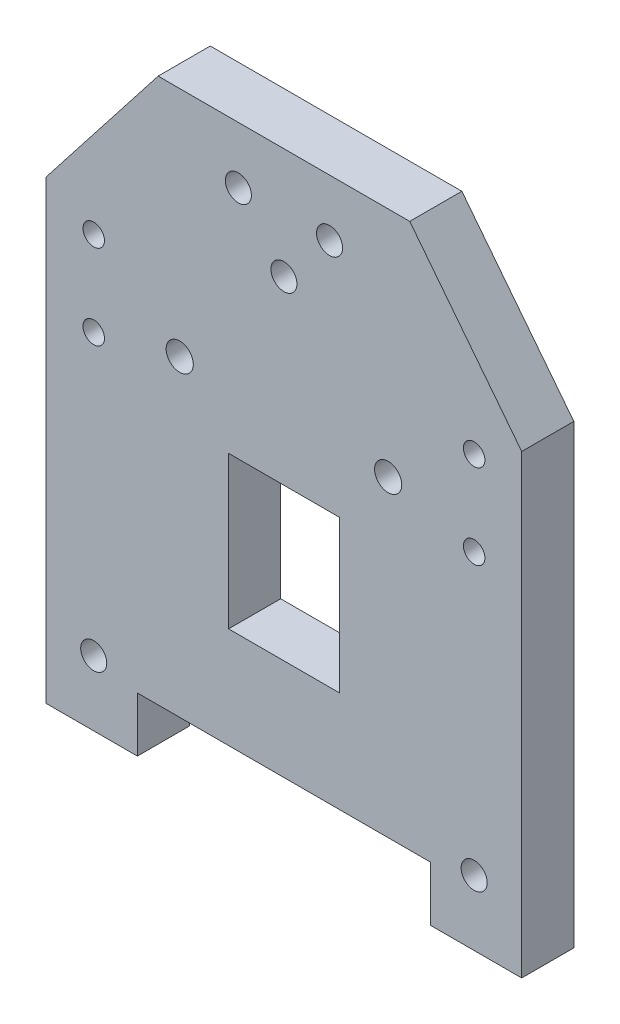
ISO-10303-21;
HEADER;
FILE_DESCRIPTION(('STEP AP214'),'2;1');
FILE_NAME('part.step','',(''),(''),'','','');
FILE_SCHEMA(('AUTOMOTIVE_DESIGN { 1 0 10303 214 1 1 1 1 }'));
ENDSEC;
DATA;
#1=APPLICATION_CONTEXT('core data for automotive mechanical design processes');
#2=APPLICATION_PROTOCOL_DEFINITION('international standard','automotive_design',2000,#1);
#3=PRODUCT_CONTEXT('',#1,'mechanical');
#4=PRODUCT('Part','Part','',(#3));
#5=PRODUCT_RELATED_PRODUCT_CATEGORY('part','',(#4));
#6=PRODUCT_DEFINITION_FORMATION('','',#4);
#7=PRODUCT_DEFINITION_CONTEXT('part definition',#1,'design');
#8=PRODUCT_DEFINITION('design','',#6,#7);
#9=PRODUCT_DEFINITION_SHAPE('','',#8);
#10=(LENGTH_UNIT() NAMED_UNIT(*) SI_UNIT(.MILLI.,.METRE.));
#11=(NAMED_UNIT(*) PLANE_ANGLE_UNIT() SI_UNIT($,.RADIAN.));
#12=(NAMED_UNIT(*) SI_UNIT($,.STERADIAN.) SOLID_ANGLE_UNIT());
#13=UNCERTAINTY_MEASURE_WITH_UNIT(LENGTH_MEASURE(1.E-05),#10,'distance_accuracy_value','');
#14=(GEOMETRIC_REPRESENTATION_CONTEXT(3) GLOBAL_UNCERTAINTY_ASSIGNED_CONTEXT((#13)) GLOBAL_UNIT_ASSIGNED_CONTEXT((#10,
#11,#12)) REPRESENTATION_CONTEXT('',''));
#15=CARTESIAN_POINT('',(0.,0.,0.));
#16=DIRECTION('',(0.,0.,1.));
#17=DIRECTION('',(1.,0.,0.));
#18=AXIS2_PLACEMENT_3D('',#15,#16,#17);
#19=CARTESIAN_POINT('',(0.,0.,8.));
#20=DIRECTION('',(0.,0.,1.));
#21=DIRECTION('',(1.,0.,0.));
#22=AXIS2_PLACEMENT_3D('',#19,#20,#21);
#23=PLANE('',#22);
#24=CARTESIAN_POINT('',(29.1999999999999,66.,8.));
#25=DIRECTION('',(0.,0.,1.));
#26=DIRECTION('',(1.,0.,0.));
#27=AXIS2_PLACEMENT_3D('',#24,#25,#26);
#28=CIRCLE('',#27,1.65);
#29=CARTESIAN_POINT('',(30.8499999999999,66.,8.));
#30=VERTEX_POINT('',#29);
#31=EDGE_CURVE('E542',#30,#30,#28,.T.);
#32=ORIENTED_EDGE('',*,*,#31,.F.);
#33=EDGE_LOOP('',(#32));
#34=FACE_BOUND('',#33,.T.);
#35=CARTESIAN_POINT('',(29.1999999999999,52.9999999999994,8.));
#36=DIRECTION('',(0.,0.,1.));
#37=DIRECTION('',(1.,0.,0.));
#38=AXIS2_PLACEMENT_3D('',#35,#36,#37);
#39=CIRCLE('',#38,1.65);
#40=CARTESIAN_POINT('',(30.8499999999999,52.9999999999994,8.));
#41=VERTEX_POINT('',#40);
#42=EDGE_CURVE('E544',#41,#41,#39,.T.);
#43=ORIENTED_EDGE('',*,*,#42,.F.);
#44=EDGE_LOOP('',(#43));
#45=FACE_BOUND('',#44,.T.);
#46=CARTESIAN_POINT('',(-29.2,52.9999999999994,8.));
#47=DIRECTION('',(0.,0.,1.));
#48=DIRECTION('',(1.,0.,0.));
#49=AXIS2_PLACEMENT_3D('',#46,#47,#48);
#50=CIRCLE('',#49,1.65);
#51=CARTESIAN_POINT('',(-27.55,52.9999999999994,8.));
#52=VERTEX_POINT('',#51);
#53=EDGE_CURVE('E550',#52,#52,#50,.T.);
#54=ORIENTED_EDGE('',*,*,#53,.F.);
#55=EDGE_LOOP('',(#54));
#56=FACE_BOUND('',#55,.T.);
#57=CARTESIAN_POINT('',(-29.2,66.,8.));
#58=DIRECTION('',(0.,0.,1.));
#59=DIRECTION('',(1.,0.,0.));
#60=AXIS2_PLACEMENT_3D('',#57,#58,#59);
#61=CIRCLE('',#60,1.65);
#62=CARTESIAN_POINT('',(-27.55,66.,8.));
#63=VERTEX_POINT('',#62);
#64=EDGE_CURVE('E556',#63,#63,#61,.T.);
#65=ORIENTED_EDGE('',*,*,#64,.F.);
#66=EDGE_LOOP('',(#65));
#67=FACE_BOUND('',#66,.T.);
#68=CARTESIAN_POINT('',(-29.2,10.,8.));
#69=DIRECTION('',(0.,0.,1.));
#70=DIRECTION('',(1.,0.,0.));
#71=AXIS2_PLACEMENT_3D('',#68,#69,#70);
#72=CIRCLE('',#71,1.99999999999999);
#73=CARTESIAN_POINT('',(-27.2,10.,8.));
#74=VERTEX_POINT('',#73);
#75=EDGE_CURVE('E571',#74,#74,#72,.T.);
#76=ORIENTED_EDGE('',*,*,#75,.F.);
#77=EDGE_LOOP('',(#76));
#78=FACE_BOUND('',#77,.T.);
#79=CARTESIAN_POINT('',(-7.,83.3,8.));
#80=DIRECTION('',(0.,0.,1.));
#81=DIRECTION('',(1.,0.,0.));
#82=AXIS2_PLACEMENT_3D('',#79,#80,#81);
#83=CIRCLE('',#82,1.99999999999999);
#84=CARTESIAN_POINT('',(-5.00000000000001,83.3,8.));
#85=VERTEX_POINT('',#84);
#86=EDGE_CURVE('E583',#85,#85,#83,.T.);
#87=ORIENTED_EDGE('',*,*,#86,.F.);
#88=EDGE_LOOP('',(#87));
#89=FACE_BOUND('',#88,.T.);
#90=CARTESIAN_POINT('',(16.,56.3545405745842,8.));
#91=DIRECTION('',(0.,0.,1.));
#92=DIRECTION('',(1.,0.,0.));
#93=AXIS2_PLACEMENT_3D('',#90,#91,#92);
#94=CIRCLE('',#93,2.08671795340706);
#95=CARTESIAN_POINT('',(18.0867179534071,56.3545405745842,8.));
#96=VERTEX_POINT('',#95);
#97=EDGE_CURVE('E595',#96,#96,#94,.T.);
#98=ORIENTED_EDGE('',*,*,#97,.F.);
#99=EDGE_LOOP('',(#98));
#100=FACE_BOUND('',#99,.T.);
#101=DIRECTION('',(1.,0.,0.));
#102=VECTOR('',#101,1.);
#103=CARTESIAN_POINT('',(0.,23.9176826946673,8.));
#104=LINE('',#103,#102);
#105=CARTESIAN_POINT('',(-8.5,23.9176826946673,8.));
#106=VERTEX_POINT('',#105);
#107=CARTESIAN_POINT('',(8.5,23.9176826946673,8.));
#108=VERTEX_POINT('',#107);
#109=EDGE_CURVE('E151',#106,#108,#104,.T.);
#110=ORIENTED_EDGE('',*,*,#109,.F.);
#111=DIRECTION('',(0.,-1.,0.));
#112=VECTOR('',#111,1.);
#113=CARTESIAN_POINT('',(-8.5,47.2571297161517,8.));
#114=LINE('',#113,#112);
#115=CARTESIAN_POINT('',(-8.5,47.2571297161517,8.));
#116=VERTEX_POINT('',#115);
#117=EDGE_CURVE('E136',#116,#106,#114,.T.);
#118=ORIENTED_EDGE('',*,*,#117,.F.);
#119=DIRECTION('',(-1.,0.,0.));
#120=VECTOR('',#119,1.);
#121=CARTESIAN_POINT('',(0.,47.2571297161517,8.));
#122=LINE('',#121,#120);
#123=CARTESIAN_POINT('',(8.5,47.2571297161517,8.));
#124=VERTEX_POINT('',#123);
#125=EDGE_CURVE('E131',#124,#116,#122,.T.);
#126=ORIENTED_EDGE('',*,*,#125,.F.);
#127=DIRECTION('',(0.,1.,0.));
#128=VECTOR('',#127,1.);
#129=CARTESIAN_POINT('',(8.5,47.2571297161517,8.));
#130=LINE('',#129,#128);
#131=EDGE_CURVE('E153',#108,#124,#130,.T.);
#132=ORIENTED_EDGE('',*,*,#131,.F.);
#133=EDGE_LOOP('',(#110,#118,#126,#132));
#134=FACE_BOUND('',#133,.T.);
#135=DIRECTION('',(-0.615661475322374,0.788010753609288,0.));
#136=VECTOR('',#135,1.);
#137=CARTESIAN_POINT('',(36.5,70.0000000000001,8.));
#138=LINE('',#137,#136);
#139=CARTESIAN_POINT('',(36.5,70.0000000000001,8.));
#140=VERTEX_POINT('',#139);
#141=CARTESIAN_POINT('',(19.311716217,92.,8.));
#142=VERTEX_POINT('',#141);
#143=EDGE_CURVE('E171',#140,#142,#138,.T.);
#144=ORIENTED_EDGE('',*,*,#143,.T.);
#145=DIRECTION('',(-1.,0.,0.));
#146=VECTOR('',#145,1.);
#147=CARTESIAN_POINT('',(19.311716217,92.,8.));
#148=LINE('',#147,#146);
#149=CARTESIAN_POINT('',(-19.311716217,92.,8.));
#150=VERTEX_POINT('',#149);
#151=EDGE_CURVE('E174',#142,#150,#148,.T.);
#152=ORIENTED_EDGE('',*,*,#151,.T.);
#153=DIRECTION('',(-0.615661475322369,-0.788010753609292,0.));
#154=VECTOR('',#153,1.);
#155=CARTESIAN_POINT('',(-19.311716217,92.,8.));
#156=LINE('',#155,#154);
#157=CARTESIAN_POINT('',(-36.5,69.9999999999999,8.));
#158=VERTEX_POINT('',#157);
#159=EDGE_CURVE('E177',#150,#158,#156,.T.);
#160=ORIENTED_EDGE('',*,*,#159,.T.);
#161=DIRECTION('',(0.,-1.,0.));
#162=VECTOR('',#161,1.);
#163=CARTESIAN_POINT('',(-36.5,69.9999999999999,8.));
#164=LINE('',#163,#162);
#165=CARTESIAN_POINT('',(-36.5,0.,8.));
#166=VERTEX_POINT('',#165);
#167=EDGE_CURVE('E179',#158,#166,#164,.T.);
#168=ORIENTED_EDGE('',*,*,#167,.T.);
#169=DIRECTION('',(1.,0.,0.));
#170=VECTOR('',#169,1.);
#171=CARTESIAN_POINT('',(-36.5,0.,8.));
#172=LINE('',#171,#170);
#173=CARTESIAN_POINT('',(-22.4999999985,0.,8.));
#174=VERTEX_POINT('',#173);
#175=EDGE_CURVE('E181',#166,#174,#172,.T.);
#176=ORIENTED_EDGE('',*,*,#175,.T.);
#177=DIRECTION('',(0.,1.,0.));
#178=VECTOR('',#177,1.);
#179=CARTESIAN_POINT('',(-22.4999999985,0.,8.));
#180=LINE('',#179,#178);
#181=CARTESIAN_POINT('',(-22.4999999985,8.400000004,8.));
#182=VERTEX_POINT('',#181);
#183=EDGE_CURVE('E183',#174,#182,#180,.T.);
#184=ORIENTED_EDGE('',*,*,#183,.T.);
#185=DIRECTION('',(1.,0.,0.));
#186=VECTOR('',#185,1.);
#187=CARTESIAN_POINT('',(-22.4999999985,8.400000004,8.));
#188=LINE('',#187,#186);
#189=CARTESIAN_POINT('',(22.4999999985,8.400000004,8.));
#190=VERTEX_POINT('',#189);
#191=EDGE_CURVE('E185',#182,#190,#188,.T.);
#192=ORIENTED_EDGE('',*,*,#191,.T.);
#193=DIRECTION('',(0.,-1.,0.));
#194=VECTOR('',#193,1.);
#195=CARTESIAN_POINT('',(22.4999999985,8.400000004,8.));
#196=LINE('',#195,#194);
#197=CARTESIAN_POINT('',(22.4999999985,0.,8.));
#198=VERTEX_POINT('',#197);
#199=EDGE_CURVE('E187',#190,#198,#196,.T.);
#200=ORIENTED_EDGE('',*,*,#199,.T.);
#201=DIRECTION('',(1.,0.,0.));
#202=VECTOR('',#201,1.);
#203=CARTESIAN_POINT('',(22.4999999985,0.,8.));
#204=LINE('',#203,#202);
#205=CARTESIAN_POINT('',(36.5,0.,8.));
#206=VERTEX_POINT('',#205);
#207=EDGE_CURVE('E189',#198,#206,#204,.T.);
#208=ORIENTED_EDGE('',*,*,#207,.T.);
#209=DIRECTION('',(0.,1.,0.));
#210=VECTOR('',#209,1.);
#211=CARTESIAN_POINT('',(36.5,0.,8.));
#212=LINE('',#211,#210);
#213=EDGE_CURVE('E191',#206,#140,#212,.T.);
#214=ORIENTED_EDGE('',*,*,#213,.T.);
#215=EDGE_LOOP('',(#144,#152,#160,#168,#176,#184,#192,#200,#208,#214));
#216=FACE_BOUND('',#215,.T.);
#217=CARTESIAN_POINT('',(-16.,56.3545405745842,8.));
#218=DIRECTION('',(0.,0.,1.));
#219=DIRECTION('',(1.,0.,0.));
#220=AXIS2_PLACEMENT_3D('',#217,#218,#219);
#221=CIRCLE('',#220,2.0867160921528);
#222=CARTESIAN_POINT('',(-13.9132839078472,56.3545405745842,8.));
#223=VERTEX_POINT('',#222);
#224=EDGE_CURVE('E160',#223,#223,#221,.T.);
#225=ORIENTED_EDGE('',*,*,#224,.F.);
#226=EDGE_LOOP('',(#225));
#227=FACE_BOUND('',#226,.T.);
#228=CARTESIAN_POINT('',(0.,75.,8.));
#229=DIRECTION('',(0.,0.,1.));
#230=DIRECTION('',(1.,0.,0.));
#231=AXIS2_PLACEMENT_3D('',#228,#229,#230);
#232=CIRCLE('',#231,1.99999999999999);
#233=CARTESIAN_POINT('',(1.99999999999999,75.,8.));
#234=VERTEX_POINT('',#233);
#235=EDGE_CURVE('E589',#234,#234,#232,.T.);
#236=ORIENTED_EDGE('',*,*,#235,.F.);
#237=EDGE_LOOP('',(#236));
#238=FACE_BOUND('',#237,.T.);
#239=CARTESIAN_POINT('',(7.,83.3,8.));
#240=DIRECTION('',(0.,0.,1.));
#241=DIRECTION('',(1.,0.,0.));
#242=AXIS2_PLACEMENT_3D('',#239,#240,#241);
#243=CIRCLE('',#242,1.99999999999999);
#244=CARTESIAN_POINT('',(8.99999999999999,83.3,8.));
#245=VERTEX_POINT('',#244);
#246=EDGE_CURVE('E577',#245,#245,#243,.T.);
#247=ORIENTED_EDGE('',*,*,#246,.F.);
#248=EDGE_LOOP('',(#247));
#249=FACE_BOUND('',#248,.T.);
#250=CARTESIAN_POINT('',(29.2,10.,8.));
#251=DIRECTION('',(0.,0.,1.));
#252=DIRECTION('',(1.,0.,0.));
#253=AXIS2_PLACEMENT_3D('',#250,#251,#252);
#254=CIRCLE('',#253,1.99999999999999);
#255=CARTESIAN_POINT('',(31.2,10.,8.));
#256=VERTEX_POINT('',#255);
#257=EDGE_CURVE('E565',#256,#256,#254,.T.);
#258=ORIENTED_EDGE('',*,*,#257,.F.);
#259=EDGE_LOOP('',(#258));
#260=FACE_BOUND('',#259,.T.);
#261=ADVANCED_FACE('F33',(#34,#45,#56,#67,#78,#89,#100,#134,#216,#227,#238,#249,#260),#23,.T.);
#262=CARTESIAN_POINT('',(0.,0.,0.));
#263=DIRECTION('',(0.,0.,1.));
#264=DIRECTION('',(1.,0.,0.));
#265=AXIS2_PLACEMENT_3D('',#262,#263,#264);
#266=PLANE('',#265);
#267=CARTESIAN_POINT('',(29.1999999999999,66.,0.));
#268=DIRECTION('',(0.,0.,1.));
#269=DIRECTION('',(1.,0.,0.));
#270=AXIS2_PLACEMENT_3D('',#267,#268,#269);
#271=CIRCLE('',#270,1.65);
#272=CARTESIAN_POINT('',(30.8499999999999,66.,0.));
#273=VERTEX_POINT('',#272);
#274=EDGE_CURVE('E540',#273,#273,#271,.T.);
#275=ORIENTED_EDGE('',*,*,#274,.T.);
#276=EDGE_LOOP('',(#275));
#277=FACE_BOUND('',#276,.T.);
#278=CARTESIAN_POINT('',(29.1999999999999,52.9999999999994,0.));
#279=DIRECTION('',(0.,0.,1.));
#280=DIRECTION('',(1.,0.,0.));
#281=AXIS2_PLACEMENT_3D('',#278,#279,#280);
#282=CIRCLE('',#281,1.65);
#283=CARTESIAN_POINT('',(30.8499999999999,52.9999999999994,0.));
#284=VERTEX_POINT('',#283);
#285=EDGE_CURVE('E547',#284,#284,#282,.T.);
#286=ORIENTED_EDGE('',*,*,#285,.T.);
#287=EDGE_LOOP('',(#286));
#288=FACE_BOUND('',#287,.T.);
#289=CARTESIAN_POINT('',(-29.2,52.9999999999994,0.));
#290=DIRECTION('',(0.,0.,1.));
#291=DIRECTION('',(1.,0.,0.));
#292=AXIS2_PLACEMENT_3D('',#289,#290,#291);
#293=CIRCLE('',#292,1.65);
#294=CARTESIAN_POINT('',(-27.55,52.9999999999994,0.));
#295=VERTEX_POINT('',#294);
#296=EDGE_CURVE('E553',#295,#295,#293,.T.);
#297=ORIENTED_EDGE('',*,*,#296,.T.);
#298=EDGE_LOOP('',(#297));
#299=FACE_BOUND('',#298,.T.);
#300=CARTESIAN_POINT('',(-29.2,66.,0.));
#301=DIRECTION('',(0.,0.,1.));
#302=DIRECTION('',(1.,0.,0.));
#303=AXIS2_PLACEMENT_3D('',#300,#301,#302);
#304=CIRCLE('',#303,1.65);
#305=CARTESIAN_POINT('',(-27.55,66.,0.));
#306=VERTEX_POINT('',#305);
#307=EDGE_CURVE('E559',#306,#306,#304,.T.);
#308=ORIENTED_EDGE('',*,*,#307,.T.);
#309=EDGE_LOOP('',(#308));
#310=FACE_BOUND('',#309,.T.);
#311=CARTESIAN_POINT('',(-29.2,10.,0.));
#312=DIRECTION('',(0.,0.,1.));
#313=DIRECTION('',(1.,0.,0.));
#314=AXIS2_PLACEMENT_3D('',#311,#312,#313);
#315=CIRCLE('',#314,1.99999999999999);
#316=CARTESIAN_POINT('',(-27.2,10.,0.));
#317=VERTEX_POINT('',#316);
#318=EDGE_CURVE('E568',#317,#317,#315,.T.);
#319=ORIENTED_EDGE('',*,*,#318,.T.);
#320=EDGE_LOOP('',(#319));
#321=FACE_BOUND('',#320,.T.);
#322=CARTESIAN_POINT('',(-7.,83.3,0.));
#323=DIRECTION('',(0.,0.,1.));
#324=DIRECTION('',(1.,0.,0.));
#325=AXIS2_PLACEMENT_3D('',#322,#323,#324);
#326=CIRCLE('',#325,1.99999999999999);
#327=CARTESIAN_POINT('',(-5.00000000000001,83.3,0.));
#328=VERTEX_POINT('',#327);
#329=EDGE_CURVE('E580',#328,#328,#326,.T.);
#330=ORIENTED_EDGE('',*,*,#329,.T.);
#331=EDGE_LOOP('',(#330));
#332=FACE_BOUND('',#331,.T.);
#333=CARTESIAN_POINT('',(16.,56.3545405745842,0.));
#334=DIRECTION('',(0.,0.,1.));
#335=DIRECTION('',(1.,0.,0.));
#336=AXIS2_PLACEMENT_3D('',#333,#334,#335);
#337=CIRCLE('',#336,2.08671795340706);
#338=CARTESIAN_POINT('',(18.0867179534071,56.3545405745842,0.));
#339=VERTEX_POINT('',#338);
#340=EDGE_CURVE('E592',#339,#339,#337,.T.);
#341=ORIENTED_EDGE('',*,*,#340,.T.);
#342=EDGE_LOOP('',(#341));
#343=FACE_BOUND('',#342,.T.);
#344=DIRECTION('',(0.,-1.,0.));
#345=VECTOR('',#344,1.);
#346=CARTESIAN_POINT('',(-8.5,47.2571297161517,0.));
#347=LINE('',#346,#345);
#348=CARTESIAN_POINT('',(-8.5,47.2571297161517,0.));
#349=VERTEX_POINT('',#348);
#350=CARTESIAN_POINT('',(-8.5,23.9176826946673,0.));
#351=VERTEX_POINT('',#350);
#352=EDGE_CURVE('E144',#349,#351,#347,.T.);
#353=ORIENTED_EDGE('',*,*,#352,.T.);
#354=DIRECTION('',(1.,0.,0.));
#355=VECTOR('',#354,1.);
#356=CARTESIAN_POINT('',(0.,23.9176826946673,0.));
#357=LINE('',#356,#355);
#358=CARTESIAN_POINT('',(8.5,23.9176826946673,0.));
#359=VERTEX_POINT('',#358);
#360=EDGE_CURVE('E159',#351,#359,#357,.T.);
#361=ORIENTED_EDGE('',*,*,#360,.T.);
#362=DIRECTION('',(0.,1.,0.));
#363=VECTOR('',#362,1.);
#364=CARTESIAN_POINT('',(8.5,47.2571297161517,0.));
#365=LINE('',#364,#363);
#366=CARTESIAN_POINT('',(8.5,47.2571297161517,0.));
#367=VERTEX_POINT('',#366);
#368=EDGE_CURVE('E163',#359,#367,#365,.T.);
#369=ORIENTED_EDGE('',*,*,#368,.T.);
#370=DIRECTION('',(-1.,0.,0.));
#371=VECTOR('',#370,1.);
#372=CARTESIAN_POINT('',(0.,47.2571297161517,0.));
#373=LINE('',#372,#371);
#374=EDGE_CURVE('E137',#367,#349,#373,.T.);
#375=ORIENTED_EDGE('',*,*,#374,.T.);
#376=EDGE_LOOP('',(#353,#361,#369,#375));
#377=FACE_BOUND('',#376,.T.);
#378=DIRECTION('',(-0.615661475322374,0.788010753609288,0.));
#379=VECTOR('',#378,1.);
#380=CARTESIAN_POINT('',(36.5,70.0000000000001,0.));
#381=LINE('',#380,#379);
#382=CARTESIAN_POINT('',(36.5,70.0000000000001,0.));
#383=VERTEX_POINT('',#382);
#384=CARTESIAN_POINT('',(19.311716217,92.,0.));
#385=VERTEX_POINT('',#384);
#386=EDGE_CURVE('E146',#383,#385,#381,.T.);
#387=ORIENTED_EDGE('',*,*,#386,.F.);
#388=DIRECTION('',(0.,1.,0.));
#389=VECTOR('',#388,1.);
#390=CARTESIAN_POINT('',(36.5,0.,0.));
#391=LINE('',#390,#389);
#392=CARTESIAN_POINT('',(36.5,0.,0.));
#393=VERTEX_POINT('',#392);
#394=EDGE_CURVE('E175',#393,#383,#391,.T.);
#395=ORIENTED_EDGE('',*,*,#394,.F.);
#396=DIRECTION('',(1.,0.,0.));
#397=VECTOR('',#396,1.);
#398=CARTESIAN_POINT('',(22.4999999985,0.,0.));
#399=LINE('',#398,#397);
#400=CARTESIAN_POINT('',(22.4999999985,0.,0.));
#401=VERTEX_POINT('',#400);
#402=EDGE_CURVE('E210',#401,#393,#399,.T.);
#403=ORIENTED_EDGE('',*,*,#402,.F.);
#404=DIRECTION('',(0.,-1.,0.));
#405=VECTOR('',#404,1.);
#406=CARTESIAN_POINT('',(22.4999999985,8.400000004,0.));
#407=LINE('',#406,#405);
#408=CARTESIAN_POINT('',(22.4999999985,8.400000004,0.));
#409=VERTEX_POINT('',#408);
#410=EDGE_CURVE('E208',#409,#401,#407,.T.);
#411=ORIENTED_EDGE('',*,*,#410,.F.);
#412=DIRECTION('',(1.,0.,0.));
#413=VECTOR('',#412,1.);
#414=CARTESIAN_POINT('',(-22.4999999985,8.400000004,0.));
#415=LINE('',#414,#413);
#416=CARTESIAN_POINT('',(-22.4999999985,8.400000004,0.));
#417=VERTEX_POINT('',#416);
#418=EDGE_CURVE('E206',#417,#409,#415,.T.);
#419=ORIENTED_EDGE('',*,*,#418,.F.);
#420=DIRECTION('',(0.,1.,0.));
#421=VECTOR('',#420,1.);
#422=CARTESIAN_POINT('',(-22.4999999985,0.,0.));
#423=LINE('',#422,#421);
#424=CARTESIAN_POINT('',(-22.4999999985,0.,0.));
#425=VERTEX_POINT('',#424);
#426=EDGE_CURVE('E204',#425,#417,#423,.T.);
#427=ORIENTED_EDGE('',*,*,#426,.F.);
#428=DIRECTION('',(1.,0.,0.));
#429=VECTOR('',#428,1.);
#430=CARTESIAN_POINT('',(-36.5,0.,0.));
#431=LINE('',#430,#429);
#432=CARTESIAN_POINT('',(-36.5,0.,0.));
#433=VERTEX_POINT('',#432);
#434=EDGE_CURVE('E202',#433,#425,#431,.T.);
#435=ORIENTED_EDGE('',*,*,#434,.F.);
#436=DIRECTION('',(0.,-1.,0.));
#437=VECTOR('',#436,1.);
#438=CARTESIAN_POINT('',(-36.5,69.9999999999999,0.));
#439=LINE('',#438,#437);
#440=CARTESIAN_POINT('',(-36.5,69.9999999999999,0.));
#441=VERTEX_POINT('',#440);
#442=EDGE_CURVE('E200',#441,#433,#439,.T.);
#443=ORIENTED_EDGE('',*,*,#442,.F.);
#444=DIRECTION('',(-0.615661475322369,-0.788010753609292,0.));
#445=VECTOR('',#444,1.);
#446=CARTESIAN_POINT('',(-19.311716217,92.,0.));
#447=LINE('',#446,#445);
#448=CARTESIAN_POINT('',(-19.311716217,92.,0.));
#449=VERTEX_POINT('',#448);
#450=EDGE_CURVE('E198',#449,#441,#447,.T.);
#451=ORIENTED_EDGE('',*,*,#450,.F.);
#452=DIRECTION('',(-1.,0.,0.));
#453=VECTOR('',#452,1.);
#454=CARTESIAN_POINT('',(19.311716217,92.,0.));
#455=LINE('',#454,#453);
#456=EDGE_CURVE('E196',#385,#449,#455,.T.);
#457=ORIENTED_EDGE('',*,*,#456,.F.);
#458=EDGE_LOOP('',(#387,#395,#403,#411,#419,#427,#435,#443,#451,#457));
#459=FACE_BOUND('',#458,.T.);
#460=CARTESIAN_POINT('',(-16.,56.3545405745842,0.));
#461=DIRECTION('',(0.,0.,1.));
#462=DIRECTION('',(1.,0.,0.));
#463=AXIS2_PLACEMENT_3D('',#460,#461,#462);
#464=CIRCLE('',#463,2.0867160921528);
#465=CARTESIAN_POINT('',(-13.9132839078472,56.3545405745842,0.));
#466=VERTEX_POINT('',#465);
#467=EDGE_CURVE('E598',#466,#466,#464,.T.);
#468=ORIENTED_EDGE('',*,*,#467,.T.);
#469=EDGE_LOOP('',(#468));
#470=FACE_BOUND('',#469,.T.);
#471=CARTESIAN_POINT('',(0.,75.,0.));
#472=DIRECTION('',(0.,0.,1.));
#473=DIRECTION('',(1.,0.,0.));
#474=AXIS2_PLACEMENT_3D('',#471,#472,#473);
#475=CIRCLE('',#474,1.99999999999999);
#476=CARTESIAN_POINT('',(1.99999999999999,75.,0.));
#477=VERTEX_POINT('',#476);
#478=EDGE_CURVE('E586',#477,#477,#475,.T.);
#479=ORIENTED_EDGE('',*,*,#478,.T.);
#480=EDGE_LOOP('',(#479));
#481=FACE_BOUND('',#480,.T.);
#482=CARTESIAN_POINT('',(7.,83.3,0.));
#483=DIRECTION('',(0.,0.,1.));
#484=DIRECTION('',(1.,0.,0.));
#485=AXIS2_PLACEMENT_3D('',#482,#483,#484);
#486=CIRCLE('',#485,1.99999999999999);
#487=CARTESIAN_POINT('',(8.99999999999999,83.3,0.));
#488=VERTEX_POINT('',#487);
#489=EDGE_CURVE('E574',#488,#488,#486,.T.);
#490=ORIENTED_EDGE('',*,*,#489,.T.);
#491=EDGE_LOOP('',(#490));
#492=FACE_BOUND('',#491,.T.);
#493=CARTESIAN_POINT('',(29.2,10.,0.));
#494=DIRECTION('',(0.,0.,1.));
#495=DIRECTION('',(1.,0.,0.));
#496=AXIS2_PLACEMENT_3D('',#493,#494,#495);
#497=CIRCLE('',#496,1.99999999999999);
#498=CARTESIAN_POINT('',(31.2,10.,0.));
#499=VERTEX_POINT('',#498);
#500=EDGE_CURVE('E562',#499,#499,#497,.T.);
#501=ORIENTED_EDGE('',*,*,#500,.T.);
#502=EDGE_LOOP('',(#501));
#503=FACE_BOUND('',#502,.T.);
#504=ADVANCED_FACE('F246',(#277,#288,#299,#310,#321,#332,#343,#377,#459,#470,#481,#492,#503),
#266,.F.);
#505=CARTESIAN_POINT('',(36.5,70.0000000000001,8.));
#506=DIRECTION('',(-0.788010753609288,-0.615661475322374,0.));
#507=DIRECTION('',(0.615661475322374,-0.788010753609288,0.));
#508=AXIS2_PLACEMENT_3D('',#505,#506,#507);
#509=PLANE('',#508);
#510=ORIENTED_EDGE('',*,*,#386,.T.);
#511=DIRECTION('',(0.,0.,-1.));
#512=VECTOR('',#511,1.);
#513=CARTESIAN_POINT('',(19.311716217,92.,8.));
#514=LINE('',#513,#512);
#515=EDGE_CURVE('E11',#142,#385,#514,.T.);
#516=ORIENTED_EDGE('',*,*,#515,.F.);
#517=ORIENTED_EDGE('',*,*,#143,.F.);
#518=DIRECTION('',(0.,0.,-1.));
#519=VECTOR('',#518,1.);
#520=CARTESIAN_POINT('',(36.5,70.0000000000001,8.));
#521=LINE('',#520,#519);
#522=EDGE_CURVE('E193',#140,#383,#521,.T.);
#523=ORIENTED_EDGE('',*,*,#522,.T.);
#524=EDGE_LOOP('',(#510,#516,#517,#523));
#525=FACE_BOUND('',#524,.T.);
#526=ADVANCED_FACE('F35',(#525),#509,.F.);
#527=CARTESIAN_POINT('',(19.311716217,92.,8.));
#528=DIRECTION('',(0.,-1.,0.));
#529=DIRECTION('',(0.,0.,-1.));
#530=AXIS2_PLACEMENT_3D('',#527,#528,#529);
#531=PLANE('',#530);
#532=ORIENTED_EDGE('',*,*,#456,.T.);
#533=DIRECTION('',(0.,0.,-1.));
#534=VECTOR('',#533,1.);
#535=CARTESIAN_POINT('',(-19.311716217,92.,8.));
#536=LINE('',#535,#534);
#537=EDGE_CURVE('E41',#150,#449,#536,.T.);
#538=ORIENTED_EDGE('',*,*,#537,.F.);
#539=ORIENTED_EDGE('',*,*,#151,.F.);
#540=ORIENTED_EDGE('',*,*,#515,.T.);
#541=EDGE_LOOP('',(#532,#538,#539,#540));
#542=FACE_BOUND('',#541,.T.);
#543=ADVANCED_FACE('F263',(#542),#531,.F.);
#544=CARTESIAN_POINT('',(-19.311716217,92.,8.));
#545=DIRECTION('',(0.788010753609292,-0.615661475322369,0.));
#546=DIRECTION('',(0.615661475322369,0.788010753609292,0.));
#547=AXIS2_PLACEMENT_3D('',#544,#545,#546);
#548=PLANE('',#547);
#549=ORIENTED_EDGE('',*,*,#450,.T.);
#550=DIRECTION('',(0.,0.,-1.));
#551=VECTOR('',#550,1.);
#552=CARTESIAN_POINT('',(-36.5,69.9999999999999,8.));
#553=LINE('',#552,#551);
#554=EDGE_CURVE('E233',#158,#441,#553,.T.);
#555=ORIENTED_EDGE('',*,*,#554,.F.);
#556=ORIENTED_EDGE('',*,*,#159,.F.);
#557=ORIENTED_EDGE('',*,*,#537,.T.);
#558=EDGE_LOOP('',(#549,#555,#556,#557));
#559=FACE_BOUND('',#558,.T.);
#560=ADVANCED_FACE('F240',(#559),#548,.F.);
#561=CARTESIAN_POINT('',(-36.5,69.9999999999999,8.));
#562=DIRECTION('',(1.,0.,0.));
#563=DIRECTION('',(0.,0.,-1.));
#564=AXIS2_PLACEMENT_3D('',#561,#562,#563);
#565=PLANE('',#564);
#566=ORIENTED_EDGE('',*,*,#442,.T.);
#567=DIRECTION('',(0.,0.,-1.));
#568=VECTOR('',#567,1.);
#569=CARTESIAN_POINT('',(-36.5,0.,8.));
#570=LINE('',#569,#568);
#571=EDGE_CURVE('E230',#166,#433,#570,.T.);
#572=ORIENTED_EDGE('',*,*,#571,.F.);
#573=ORIENTED_EDGE('',*,*,#167,.F.);
#574=ORIENTED_EDGE('',*,*,#554,.T.);
#575=EDGE_LOOP('',(#566,#572,#573,#574));
#576=FACE_BOUND('',#575,.T.);
#577=ADVANCED_FACE('F252',(#576),#565,.F.);
#578=CARTESIAN_POINT('',(-36.5,0.,8.));
#579=DIRECTION('',(0.,1.,0.));
#580=DIRECTION('',(0.,0.,1.));
#581=AXIS2_PLACEMENT_3D('',#578,#579,#580);
#582=PLANE('',#581);
#583=ORIENTED_EDGE('',*,*,#434,.T.);
#584=DIRECTION('',(0.,0.,-1.));
#585=VECTOR('',#584,1.);
#586=CARTESIAN_POINT('',(-22.4999999985,0.,8.));
#587=LINE('',#586,#585);
#588=EDGE_CURVE('E227',#174,#425,#587,.T.);
#589=ORIENTED_EDGE('',*,*,#588,.F.);
#590=ORIENTED_EDGE('',*,*,#175,.F.);
#591=ORIENTED_EDGE('',*,*,#571,.T.);
#592=EDGE_LOOP('',(#583,#589,#590,#591));
#593=FACE_BOUND('',#592,.T.);
#594=ADVANCED_FACE('F256',(#593),#582,.F.);
#595=CARTESIAN_POINT('',(-22.4999999985,0.,8.));
#596=DIRECTION('',(-1.,0.,0.));
#597=DIRECTION('',(0.,0.,1.));
#598=AXIS2_PLACEMENT_3D('',#595,#596,#597);
#599=PLANE('',#598);
#600=ORIENTED_EDGE('',*,*,#426,.T.);
#601=DIRECTION('',(0.,0.,-1.));
#602=VECTOR('',#601,1.);
#603=CARTESIAN_POINT('',(-22.4999999985,8.400000004,8.));
#604=LINE('',#603,#602);
#605=EDGE_CURVE('E224',#182,#417,#604,.T.);
#606=ORIENTED_EDGE('',*,*,#605,.F.);
#607=ORIENTED_EDGE('',*,*,#183,.F.);
#608=ORIENTED_EDGE('',*,*,#588,.T.);
#609=EDGE_LOOP('',(#600,#606,#607,#608));
#610=FACE_BOUND('',#609,.T.);
#611=ADVANCED_FACE('F286',(#610),#599,.F.);
#612=CARTESIAN_POINT('',(-22.4999999985,8.400000004,8.));
#613=DIRECTION('',(0.,1.,0.));
#614=DIRECTION('',(0.,0.,1.));
#615=AXIS2_PLACEMENT_3D('',#612,#613,#614);
#616=PLANE('',#615);
#617=ORIENTED_EDGE('',*,*,#418,.T.);
#618=DIRECTION('',(0.,0.,-1.));
#619=VECTOR('',#618,1.);
#620=CARTESIAN_POINT('',(22.4999999985,8.400000004,8.));
#621=LINE('',#620,#619);
#622=EDGE_CURVE('E221',#190,#409,#621,.T.);
#623=ORIENTED_EDGE('',*,*,#622,.F.);
#624=ORIENTED_EDGE('',*,*,#191,.F.);
#625=ORIENTED_EDGE('',*,*,#605,.T.);
#626=EDGE_LOOP('',(#617,#623,#624,#625));
#627=FACE_BOUND('',#626,.T.);
#628=ADVANCED_FACE('F283',(#627),#616,.F.);
#629=CARTESIAN_POINT('',(22.4999999985,8.400000004,8.));
#630=DIRECTION('',(1.,0.,0.));
#631=DIRECTION('',(0.,0.,-1.));
#632=AXIS2_PLACEMENT_3D('',#629,#630,#631);
#633=PLANE('',#632);
#634=ORIENTED_EDGE('',*,*,#410,.T.);
#635=DIRECTION('',(0.,0.,-1.));
#636=VECTOR('',#635,1.);
#637=CARTESIAN_POINT('',(22.4999999985,0.,8.));
#638=LINE('',#637,#636);
#639=EDGE_CURVE('E218',#198,#401,#638,.T.);
#640=ORIENTED_EDGE('',*,*,#639,.F.);
#641=ORIENTED_EDGE('',*,*,#199,.F.);
#642=ORIENTED_EDGE('',*,*,#622,.T.);
#643=EDGE_LOOP('',(#634,#640,#641,#642));
#644=FACE_BOUND('',#643,.T.);
#645=ADVANCED_FACE('F279',(#644),#633,.F.);
#646=CARTESIAN_POINT('',(22.4999999985,0.,8.));
#647=DIRECTION('',(0.,1.,0.));
#648=DIRECTION('',(0.,0.,1.));
#649=AXIS2_PLACEMENT_3D('',#646,#647,#648);
#650=PLANE('',#649);
#651=ORIENTED_EDGE('',*,*,#402,.T.);
#652=DIRECTION('',(0.,0.,-1.));
#653=VECTOR('',#652,1.);
#654=CARTESIAN_POINT('',(36.5,0.,8.));
#655=LINE('',#654,#653);
#656=EDGE_CURVE('E215',#206,#393,#655,.T.);
#657=ORIENTED_EDGE('',*,*,#656,.F.);
#658=ORIENTED_EDGE('',*,*,#207,.F.);
#659=ORIENTED_EDGE('',*,*,#639,.T.);
#660=EDGE_LOOP('',(#651,#657,#658,#659));
#661=FACE_BOUND('',#660,.T.);
#662=ADVANCED_FACE('F275',(#661),#650,.F.);
#663=CARTESIAN_POINT('',(36.5,0.,8.));
#664=DIRECTION('',(-1.,0.,0.));
#665=DIRECTION('',(0.,-1.,0.));
#666=AXIS2_PLACEMENT_3D('',#663,#664,#665);
#667=PLANE('',#666);
#668=ORIENTED_EDGE('',*,*,#394,.T.);
#669=ORIENTED_EDGE('',*,*,#522,.F.);
#670=ORIENTED_EDGE('',*,*,#213,.F.);
#671=ORIENTED_EDGE('',*,*,#656,.T.);
#672=EDGE_LOOP('',(#668,#669,#670,#671));
#673=FACE_BOUND('',#672,.T.);
#674=ADVANCED_FACE('F270',(#673),#667,.F.);
#675=CARTESIAN_POINT('',(-8.5,47.2571297161517,8.));
#676=DIRECTION('',(1.,0.,0.));
#677=DIRECTION('',(0.,0.,-1.));
#678=AXIS2_PLACEMENT_3D('',#675,#676,#677);
#679=PLANE('',#678);
#680=ORIENTED_EDGE('',*,*,#352,.F.);
#681=DIRECTION('',(0.,0.,-1.));
#682=VECTOR('',#681,1.);
#683=CARTESIAN_POINT('',(-8.5,47.2571297161517,8.));
#684=LINE('',#683,#682);
#685=EDGE_CURVE('E53',#116,#349,#684,.T.);
#686=ORIENTED_EDGE('',*,*,#685,.F.);
#687=ORIENTED_EDGE('',*,*,#117,.T.);
#688=DIRECTION('',(0.,0.,-1.));
#689=VECTOR('',#688,1.);
#690=CARTESIAN_POINT('',(-8.5,23.9176826946673,8.));
#691=LINE('',#690,#689);
#692=EDGE_CURVE('E147',#106,#351,#691,.T.);
#693=ORIENTED_EDGE('',*,*,#692,.T.);
#694=EDGE_LOOP('',(#680,#686,#687,#693));
#695=FACE_BOUND('',#694,.T.);
#696=ADVANCED_FACE('F140',(#695),#679,.T.);
#697=CARTESIAN_POINT('',(0.,23.9176826946673,8.));
#698=DIRECTION('',(0.,1.,0.));
#699=DIRECTION('',(0.,0.,1.));
#700=AXIS2_PLACEMENT_3D('',#697,#698,#699);
#701=PLANE('',#700);
#702=ORIENTED_EDGE('',*,*,#360,.F.);
#703=ORIENTED_EDGE('',*,*,#692,.F.);
#704=ORIENTED_EDGE('',*,*,#109,.T.);
#705=DIRECTION('',(0.,0.,-1.));
#706=VECTOR('',#705,1.);
#707=CARTESIAN_POINT('',(8.5,23.9176826946673,8.));
#708=LINE('',#707,#706);
#709=EDGE_CURVE('E168',#108,#359,#708,.T.);
#710=ORIENTED_EDGE('',*,*,#709,.T.);
#711=EDGE_LOOP('',(#702,#703,#704,#710));
#712=FACE_BOUND('',#711,.T.);
#713=ADVANCED_FACE('F332',(#712),#701,.T.);
#714=CARTESIAN_POINT('',(8.5,47.2571297161517,8.));
#715=DIRECTION('',(-1.,0.,0.));
#716=DIRECTION('',(0.,0.,1.));
#717=AXIS2_PLACEMENT_3D('',#714,#715,#716);
#718=PLANE('',#717);
#719=ORIENTED_EDGE('',*,*,#368,.F.);
#720=ORIENTED_EDGE('',*,*,#709,.F.);
#721=ORIENTED_EDGE('',*,*,#131,.T.);
#722=DIRECTION('',(0.,0.,-1.));
#723=VECTOR('',#722,1.);
#724=CARTESIAN_POINT('',(8.5,47.2571297161517,8.));
#725=LINE('',#724,#723);
#726=EDGE_CURVE('E48',#124,#367,#725,.T.);
#727=ORIENTED_EDGE('',*,*,#726,.T.);
#728=EDGE_LOOP('',(#719,#720,#721,#727));
#729=FACE_BOUND('',#728,.T.);
#730=ADVANCED_FACE('F338',(#729),#718,.T.);
#731=CARTESIAN_POINT('',(0.,47.2571297161517,8.));
#732=DIRECTION('',(0.,-1.,0.));
#733=DIRECTION('',(0.,0.,-1.));
#734=AXIS2_PLACEMENT_3D('',#731,#732,#733);
#735=PLANE('',#734);
#736=ORIENTED_EDGE('',*,*,#374,.F.);
#737=ORIENTED_EDGE('',*,*,#726,.F.);
#738=ORIENTED_EDGE('',*,*,#125,.T.);
#739=ORIENTED_EDGE('',*,*,#685,.T.);
#740=EDGE_LOOP('',(#736,#737,#738,#739));
#741=FACE_BOUND('',#740,.T.);
#742=ADVANCED_FACE('F132',(#741),#735,.T.);
#743=CARTESIAN_POINT('',(-16.,56.3545405745842,8.));
#744=DIRECTION('',(0.,0.,-1.));
#745=DIRECTION('',(-1.,0.,0.));
#746=AXIS2_PLACEMENT_3D('',#743,#744,#745);
#747=CYLINDRICAL_SURFACE('',#746,2.0867160921528);
#748=ORIENTED_EDGE('',*,*,#224,.T.);
#749=EDGE_LOOP('',(#748));
#750=FACE_BOUND('',#749,.T.);
#751=ORIENTED_EDGE('',*,*,#467,.F.);
#752=EDGE_LOOP('',(#751));
#753=FACE_BOUND('',#752,.T.);
#754=ADVANCED_FACE('F352',(#750,#753),#747,.F.);
#755=CARTESIAN_POINT('',(16.,56.3545405745842,8.));
#756=DIRECTION('',(0.,0.,-1.));
#757=DIRECTION('',(-1.,0.,0.));
#758=AXIS2_PLACEMENT_3D('',#755,#756,#757);
#759=CYLINDRICAL_SURFACE('',#758,2.08671795340706);
#760=ORIENTED_EDGE('',*,*,#97,.T.);
#761=EDGE_LOOP('',(#760));
#762=FACE_BOUND('',#761,.T.);
#763=ORIENTED_EDGE('',*,*,#340,.F.);
#764=EDGE_LOOP('',(#763));
#765=FACE_BOUND('',#764,.T.);
#766=ADVANCED_FACE('F359',(#762,#765),#759,.F.);
#767=CARTESIAN_POINT('',(0.,75.,8.));
#768=DIRECTION('',(0.,0.,-1.));
#769=DIRECTION('',(-1.,0.,0.));
#770=AXIS2_PLACEMENT_3D('',#767,#768,#769);
#771=CYLINDRICAL_SURFACE('',#770,1.99999999999999);
#772=ORIENTED_EDGE('',*,*,#235,.T.);
#773=EDGE_LOOP('',(#772));
#774=FACE_BOUND('',#773,.T.);
#775=ORIENTED_EDGE('',*,*,#478,.F.);
#776=EDGE_LOOP('',(#775));
#777=FACE_BOUND('',#776,.T.);
#778=ADVANCED_FACE('F367',(#774,#777),#771,.F.);
#779=CARTESIAN_POINT('',(-7.,83.3,8.));
#780=DIRECTION('',(0.,0.,-1.));
#781=DIRECTION('',(-1.,0.,0.));
#782=AXIS2_PLACEMENT_3D('',#779,#780,#781);
#783=CYLINDRICAL_SURFACE('',#782,1.99999999999999);
#784=ORIENTED_EDGE('',*,*,#86,.T.);
#785=EDGE_LOOP('',(#784));
#786=FACE_BOUND('',#785,.T.);
#787=ORIENTED_EDGE('',*,*,#329,.F.);
#788=EDGE_LOOP('',(#787));
#789=FACE_BOUND('',#788,.T.);
#790=ADVANCED_FACE('F375',(#786,#789),#783,.F.);
#791=CARTESIAN_POINT('',(7.,83.3,8.));
#792=DIRECTION('',(0.,0.,-1.));
#793=DIRECTION('',(-1.,0.,0.));
#794=AXIS2_PLACEMENT_3D('',#791,#792,#793);
#795=CYLINDRICAL_SURFACE('',#794,1.99999999999999);
#796=ORIENTED_EDGE('',*,*,#246,.T.);
#797=EDGE_LOOP('',(#796));
#798=FACE_BOUND('',#797,.T.);
#799=ORIENTED_EDGE('',*,*,#489,.F.);
#800=EDGE_LOOP('',(#799));
#801=FACE_BOUND('',#800,.T.);
#802=ADVANCED_FACE('F383',(#798,#801),#795,.F.);
#803=CARTESIAN_POINT('',(-29.2,10.,8.));
#804=DIRECTION('',(0.,0.,-1.));
#805=DIRECTION('',(-1.,0.,0.));
#806=AXIS2_PLACEMENT_3D('',#803,#804,#805);
#807=CYLINDRICAL_SURFACE('',#806,1.99999999999999);
#808=ORIENTED_EDGE('',*,*,#75,.T.);
#809=EDGE_LOOP('',(#808));
#810=FACE_BOUND('',#809,.T.);
#811=ORIENTED_EDGE('',*,*,#318,.F.);
#812=EDGE_LOOP('',(#811));
#813=FACE_BOUND('',#812,.T.);
#814=ADVANCED_FACE('F391',(#810,#813),#807,.F.);
#815=CARTESIAN_POINT('',(29.2,10.,8.));
#816=DIRECTION('',(0.,0.,-1.));
#817=DIRECTION('',(-1.,0.,0.));
#818=AXIS2_PLACEMENT_3D('',#815,#816,#817);
#819=CYLINDRICAL_SURFACE('',#818,1.99999999999999);
#820=ORIENTED_EDGE('',*,*,#257,.T.);
#821=EDGE_LOOP('',(#820));
#822=FACE_BOUND('',#821,.T.);
#823=ORIENTED_EDGE('',*,*,#500,.F.);
#824=EDGE_LOOP('',(#823));
#825=FACE_BOUND('',#824,.T.);
#826=ADVANCED_FACE('F399',(#822,#825),#819,.F.);
#827=CARTESIAN_POINT('',(-29.2,66.,0.));
#828=DIRECTION('',(0.,0.,1.));
#829=DIRECTION('',(1.,0.,0.));
#830=AXIS2_PLACEMENT_3D('',#827,#828,#829);
#831=CYLINDRICAL_SURFACE('',#830,1.65);
#832=ORIENTED_EDGE('',*,*,#307,.F.);
#833=EDGE_LOOP('',(#832));
#834=FACE_BOUND('',#833,.T.);
#835=ORIENTED_EDGE('',*,*,#64,.T.);
#836=EDGE_LOOP('',(#835));
#837=FACE_BOUND('',#836,.T.);
#838=ADVANCED_FACE('F406',(#834,#837),#831,.F.);
#839=CARTESIAN_POINT('',(-29.2,52.9999999999994,0.));
#840=DIRECTION('',(0.,0.,1.));
#841=DIRECTION('',(1.,0.,0.));
#842=AXIS2_PLACEMENT_3D('',#839,#840,#841);
#843=CYLINDRICAL_SURFACE('',#842,1.65);
#844=ORIENTED_EDGE('',*,*,#296,.F.);
#845=EDGE_LOOP('',(#844));
#846=FACE_BOUND('',#845,.T.);
#847=ORIENTED_EDGE('',*,*,#53,.T.);
#848=EDGE_LOOP('',(#847));
#849=FACE_BOUND('',#848,.T.);
#850=ADVANCED_FACE('F414',(#846,#849),#843,.F.);
#851=CARTESIAN_POINT('',(29.1999999999999,52.9999999999994,0.));
#852=DIRECTION('',(0.,0.,1.));
#853=DIRECTION('',(1.,0.,0.));
#854=AXIS2_PLACEMENT_3D('',#851,#852,#853);
#855=CYLINDRICAL_SURFACE('',#854,1.65);
#856=ORIENTED_EDGE('',*,*,#285,.F.);
#857=EDGE_LOOP('',(#856));
#858=FACE_BOUND('',#857,.T.);
#859=ORIENTED_EDGE('',*,*,#42,.T.);
#860=EDGE_LOOP('',(#859));
#861=FACE_BOUND('',#860,.T.);
#862=ADVANCED_FACE('F422',(#858,#861),#855,.F.);
#863=CARTESIAN_POINT('',(29.1999999999999,66.,0.));
#864=DIRECTION('',(0.,0.,1.));
#865=DIRECTION('',(1.,0.,0.));
#866=AXIS2_PLACEMENT_3D('',#863,#864,#865);
#867=CYLINDRICAL_SURFACE('',#866,1.65);
#868=ORIENTED_EDGE('',*,*,#274,.F.);
#869=EDGE_LOOP('',(#868));
#870=FACE_BOUND('',#869,.T.);
#871=ORIENTED_EDGE('',*,*,#31,.T.);
#872=EDGE_LOOP('',(#871));
#873=FACE_BOUND('',#872,.T.);
#874=ADVANCED_FACE('F430',(#870,#873),#867,.F.);
#875=CLOSED_SHELL('',(#261,#504,#526,#543,#560,#577,#594,#611,#628,#645,#662,#674,#696,#713,
#730,#742,#754,#766,#778,#790,#802,#814,#826,#838,#850,#862,#874));
#876=MANIFOLD_SOLID_BREP('B2',#875);
#877=ADVANCED_BREP_SHAPE_REPRESENTATION('',(#18,#876),#14);
#878=SHAPE_DEFINITION_REPRESENTATION(#9,#877);
ENDSEC;
END-ISO-10303-21;
